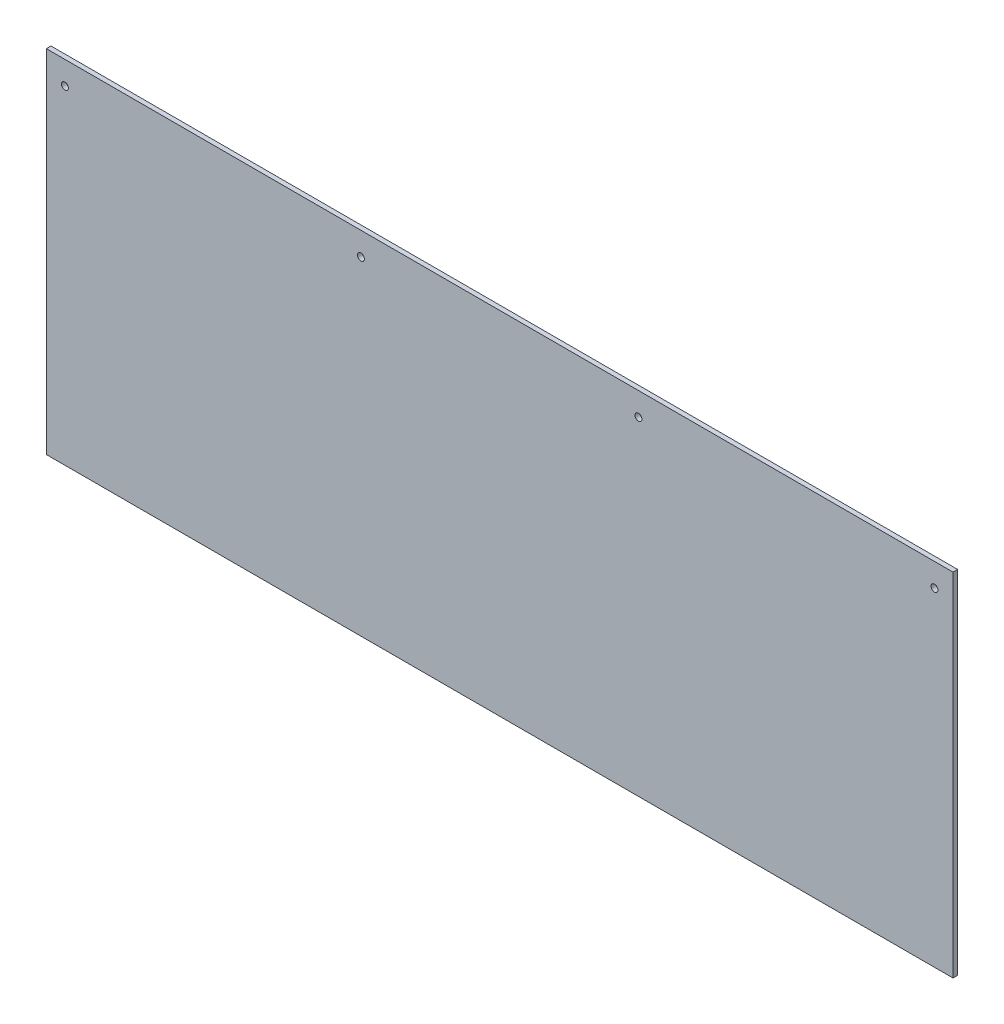
ISO-10303-21;
HEADER;
FILE_DESCRIPTION(('STEP AP214'),'2;1');
FILE_NAME('part.step','',(''),(''),'','','');
FILE_SCHEMA(('AUTOMOTIVE_DESIGN { 1 0 10303 214 1 1 1 1 }'));
ENDSEC;
DATA;
#1=APPLICATION_CONTEXT('core data for automotive mechanical design processes');
#2=APPLICATION_PROTOCOL_DEFINITION('international standard','automotive_design',2000,#1);
#3=PRODUCT_CONTEXT('',#1,'mechanical');
#4=PRODUCT('Part','Part','',(#3));
#5=PRODUCT_RELATED_PRODUCT_CATEGORY('part','',(#4));
#6=PRODUCT_DEFINITION_FORMATION('','',#4);
#7=PRODUCT_DEFINITION_CONTEXT('part definition',#1,'design');
#8=PRODUCT_DEFINITION('design','',#6,#7);
#9=PRODUCT_DEFINITION_SHAPE('','',#8);
#10=(LENGTH_UNIT() NAMED_UNIT(*) SI_UNIT(.MILLI.,.METRE.));
#11=(NAMED_UNIT(*) PLANE_ANGLE_UNIT() SI_UNIT($,.RADIAN.));
#12=(NAMED_UNIT(*) SI_UNIT($,.STERADIAN.) SOLID_ANGLE_UNIT());
#13=UNCERTAINTY_MEASURE_WITH_UNIT(LENGTH_MEASURE(1.E-05),#10,'distance_accuracy_value','');
#14=(GEOMETRIC_REPRESENTATION_CONTEXT(3) GLOBAL_UNCERTAINTY_ASSIGNED_CONTEXT((#13)) GLOBAL_UNIT_ASSIGNED_CONTEXT((#10,
#11,#12)) REPRESENTATION_CONTEXT('',''));
#15=CARTESIAN_POINT('',(0.,0.,0.));
#16=DIRECTION('',(0.,0.,1.));
#17=DIRECTION('',(1.,0.,0.));
#18=AXIS2_PLACEMENT_3D('',#15,#16,#17);
#19=CARTESIAN_POINT('',(0.,0.,6.35));
#20=DIRECTION('',(1.,0.,0.));
#21=DIRECTION('',(0.,0.,-1.));
#22=AXIS2_PLACEMENT_3D('',#19,#20,#21);
#23=PLANE('',#22);
#24=DIRECTION('',(0.,-1.,0.));
#25=VECTOR('',#24,1.);
#26=CARTESIAN_POINT('',(0.,0.,0.));
#27=LINE('',#26,#25);
#28=CARTESIAN_POINT('',(0.,482.6,0.));
#29=VERTEX_POINT('',#28);
#30=CARTESIAN_POINT('',(0.,0.,0.));
#31=VERTEX_POINT('',#30);
#32=EDGE_CURVE('E95',#29,#31,#27,.T.);
#33=ORIENTED_EDGE('',*,*,#32,.T.);
#34=DIRECTION('',(0.,0.,-1.));
#35=VECTOR('',#34,1.);
#36=CARTESIAN_POINT('',(0.,0.,6.35));
#37=LINE('',#36,#35);
#38=CARTESIAN_POINT('',(0.,0.,6.35));
#39=VERTEX_POINT('',#38);
#40=EDGE_CURVE('E11',#39,#31,#37,.T.);
#41=ORIENTED_EDGE('',*,*,#40,.F.);
#42=DIRECTION('',(0.,-1.,0.));
#43=VECTOR('',#42,1.);
#44=CARTESIAN_POINT('',(0.,0.,6.35));
#45=LINE('',#44,#43);
#46=CARTESIAN_POINT('',(0.,482.6,6.35));
#47=VERTEX_POINT('',#46);
#48=EDGE_CURVE('E83',#47,#39,#45,.T.);
#49=ORIENTED_EDGE('',*,*,#48,.F.);
#50=DIRECTION('',(0.,0.,-1.));
#51=VECTOR('',#50,1.);
#52=CARTESIAN_POINT('',(0.,482.6,6.35));
#53=LINE('',#52,#51);
#54=EDGE_CURVE('E91',#47,#29,#53,.T.);
#55=ORIENTED_EDGE('',*,*,#54,.T.);
#56=EDGE_LOOP('',(#33,#41,#49,#55));
#57=FACE_BOUND('',#56,.T.);
#58=ADVANCED_FACE('F32',(#57),#23,.F.);
#59=CARTESIAN_POINT('',(0.,0.,6.35));
#60=DIRECTION('',(0.,1.,0.));
#61=DIRECTION('',(0.,0.,1.));
#62=AXIS2_PLACEMENT_3D('',#59,#60,#61);
#63=PLANE('',#62);
#64=DIRECTION('',(1.,0.,0.));
#65=VECTOR('',#64,1.);
#66=CARTESIAN_POINT('',(0.,0.,0.));
#67=LINE('',#66,#65);
#68=CARTESIAN_POINT('',(1244.6,0.,0.));
#69=VERTEX_POINT('',#68);
#70=EDGE_CURVE('E87',#31,#69,#67,.T.);
#71=ORIENTED_EDGE('',*,*,#70,.T.);
#72=DIRECTION('',(0.,0.,-1.));
#73=VECTOR('',#72,1.);
#74=CARTESIAN_POINT('',(1244.6,0.,6.35));
#75=LINE('',#74,#73);
#76=CARTESIAN_POINT('',(1244.6,0.,6.35));
#77=VERTEX_POINT('',#76);
#78=EDGE_CURVE('E40',#77,#69,#75,.T.);
#79=ORIENTED_EDGE('',*,*,#78,.F.);
#80=DIRECTION('',(1.,0.,0.));
#81=VECTOR('',#80,1.);
#82=CARTESIAN_POINT('',(0.,0.,6.35));
#83=LINE('',#82,#81);
#84=EDGE_CURVE('E78',#39,#77,#83,.T.);
#85=ORIENTED_EDGE('',*,*,#84,.F.);
#86=ORIENTED_EDGE('',*,*,#40,.T.);
#87=EDGE_LOOP('',(#71,#79,#85,#86));
#88=FACE_BOUND('',#87,.T.);
#89=ADVANCED_FACE('F86',(#88),#63,.F.);
#90=CARTESIAN_POINT('',(1244.6,0.,6.35));
#91=DIRECTION('',(-1.,0.,0.));
#92=DIRECTION('',(0.,0.,1.));
#93=AXIS2_PLACEMENT_3D('',#90,#91,#92);
#94=PLANE('',#93);
#95=DIRECTION('',(0.,1.,0.));
#96=VECTOR('',#95,1.);
#97=CARTESIAN_POINT('',(1244.6,0.,0.));
#98=LINE('',#97,#96);
#99=CARTESIAN_POINT('',(1244.6,482.6,0.));
#100=VERTEX_POINT('',#99);
#101=EDGE_CURVE('E65',#69,#100,#98,.T.);
#102=ORIENTED_EDGE('',*,*,#101,.T.);
#103=DIRECTION('',(0.,0.,-1.));
#104=VECTOR('',#103,1.);
#105=CARTESIAN_POINT('',(1244.6,482.6,6.35));
#106=LINE('',#105,#104);
#107=CARTESIAN_POINT('',(1244.6,482.6,6.35));
#108=VERTEX_POINT('',#107);
#109=EDGE_CURVE('E88',#108,#100,#106,.T.);
#110=ORIENTED_EDGE('',*,*,#109,.F.);
#111=DIRECTION('',(0.,1.,0.));
#112=VECTOR('',#111,1.);
#113=CARTESIAN_POINT('',(1244.6,0.,6.35));
#114=LINE('',#113,#112);
#115=EDGE_CURVE('E81',#77,#108,#114,.T.);
#116=ORIENTED_EDGE('',*,*,#115,.F.);
#117=ORIENTED_EDGE('',*,*,#78,.T.);
#118=EDGE_LOOP('',(#102,#110,#116,#117));
#119=FACE_BOUND('',#118,.T.);
#120=ADVANCED_FACE('F89',(#119),#94,.F.);
#121=CARTESIAN_POINT('',(0.,482.6,6.35));
#122=DIRECTION('',(0.,-1.,0.));
#123=DIRECTION('',(1.,0.,0.));
#124=AXIS2_PLACEMENT_3D('',#121,#122,#123);
#125=PLANE('',#124);
#126=DIRECTION('',(-1.,0.,0.));
#127=VECTOR('',#126,1.);
#128=CARTESIAN_POINT('',(0.,482.6,0.));
#129=LINE('',#128,#127);
#130=EDGE_CURVE('E71',#100,#29,#129,.T.);
#131=ORIENTED_EDGE('',*,*,#130,.T.);
#132=ORIENTED_EDGE('',*,*,#54,.F.);
#133=DIRECTION('',(-1.,0.,0.));
#134=VECTOR('',#133,1.);
#135=CARTESIAN_POINT('',(0.,482.6,6.35));
#136=LINE('',#135,#134);
#137=EDGE_CURVE('E48',#108,#47,#136,.T.);
#138=ORIENTED_EDGE('',*,*,#137,.F.);
#139=ORIENTED_EDGE('',*,*,#109,.T.);
#140=EDGE_LOOP('',(#131,#132,#138,#139));
#141=FACE_BOUND('',#140,.T.);
#142=ADVANCED_FACE('F103',(#141),#125,.F.);
#143=CARTESIAN_POINT('',(0.,0.,6.35));
#144=DIRECTION('',(0.,0.,-1.));
#145=DIRECTION('',(-1.,0.,0.));
#146=AXIS2_PLACEMENT_3D('',#143,#144,#145);
#147=PLANE('',#146);
#148=CARTESIAN_POINT('',(25.4,450.85,6.35));
#149=DIRECTION('',(0.,0.,1.));
#150=DIRECTION('',(1.,0.,0.));
#151=AXIS2_PLACEMENT_3D('',#148,#149,#150);
#152=CIRCLE('',#151,4.7625);
#153=CARTESIAN_POINT('',(30.1625,450.85,6.35));
#154=VERTEX_POINT('',#153);
#155=EDGE_CURVE('E127',#154,#154,#152,.T.);
#156=ORIENTED_EDGE('',*,*,#155,.F.);
#157=EDGE_LOOP('',(#156));
#158=FACE_BOUND('',#157,.T.);
#159=CARTESIAN_POINT('',(431.8,450.85,6.35));
#160=DIRECTION('',(0.,0.,1.));
#161=DIRECTION('',(1.,0.,0.));
#162=AXIS2_PLACEMENT_3D('',#159,#160,#161);
#163=CIRCLE('',#162,4.76250000000001);
#164=CARTESIAN_POINT('',(436.5625,450.85,6.35));
#165=VERTEX_POINT('',#164);
#166=EDGE_CURVE('E121',#165,#165,#163,.T.);
#167=ORIENTED_EDGE('',*,*,#166,.F.);
#168=EDGE_LOOP('',(#167));
#169=FACE_BOUND('',#168,.T.);
#170=CARTESIAN_POINT('',(812.8,450.85,6.35));
#171=DIRECTION('',(0.,0.,1.));
#172=DIRECTION('',(1.,0.,0.));
#173=AXIS2_PLACEMENT_3D('',#170,#171,#172);
#174=CIRCLE('',#173,4.76250000000001);
#175=CARTESIAN_POINT('',(817.5625,450.85,6.35));
#176=VERTEX_POINT('',#175);
#177=EDGE_CURVE('E115',#176,#176,#174,.T.);
#178=ORIENTED_EDGE('',*,*,#177,.F.);
#179=EDGE_LOOP('',(#178));
#180=FACE_BOUND('',#179,.T.);
#181=CARTESIAN_POINT('',(1219.2,450.85,6.35));
#182=DIRECTION('',(0.,0.,1.));
#183=DIRECTION('',(1.,0.,0.));
#184=AXIS2_PLACEMENT_3D('',#181,#182,#183);
#185=CIRCLE('',#184,4.7624999999999);
#186=CARTESIAN_POINT('',(1223.9625,450.85,6.35));
#187=VERTEX_POINT('',#186);
#188=EDGE_CURVE('E109',#187,#187,#185,.T.);
#189=ORIENTED_EDGE('',*,*,#188,.F.);
#190=EDGE_LOOP('',(#189));
#191=FACE_BOUND('',#190,.T.);
#192=ORIENTED_EDGE('',*,*,#48,.T.);
#193=ORIENTED_EDGE('',*,*,#84,.T.);
#194=ORIENTED_EDGE('',*,*,#115,.T.);
#195=ORIENTED_EDGE('',*,*,#137,.T.);
#196=EDGE_LOOP('',(#192,#193,#194,#195));
#197=FACE_BOUND('',#196,.T.);
#198=ADVANCED_FACE('F79',(#158,#169,#180,#191,#197),#147,.F.);
#199=CARTESIAN_POINT('',(0.,0.,0.));
#200=DIRECTION('',(0.,0.,-1.));
#201=DIRECTION('',(-1.,0.,0.));
#202=AXIS2_PLACEMENT_3D('',#199,#200,#201);
#203=PLANE('',#202);
#204=CARTESIAN_POINT('',(25.4,450.85,0.));
#205=DIRECTION('',(0.,0.,1.));
#206=DIRECTION('',(1.,0.,0.));
#207=AXIS2_PLACEMENT_3D('',#204,#205,#206);
#208=CIRCLE('',#207,4.7625);
#209=CARTESIAN_POINT('',(30.1625,450.85,0.));
#210=VERTEX_POINT('',#209);
#211=EDGE_CURVE('E98',#210,#210,#208,.T.);
#212=ORIENTED_EDGE('',*,*,#211,.T.);
#213=EDGE_LOOP('',(#212));
#214=FACE_BOUND('',#213,.T.);
#215=CARTESIAN_POINT('',(431.8,450.85,0.));
#216=DIRECTION('',(0.,0.,1.));
#217=DIRECTION('',(1.,0.,0.));
#218=AXIS2_PLACEMENT_3D('',#215,#216,#217);
#219=CIRCLE('',#218,4.76250000000001);
#220=CARTESIAN_POINT('',(436.5625,450.85,0.));
#221=VERTEX_POINT('',#220);
#222=EDGE_CURVE('E124',#221,#221,#219,.T.);
#223=ORIENTED_EDGE('',*,*,#222,.T.);
#224=EDGE_LOOP('',(#223));
#225=FACE_BOUND('',#224,.T.);
#226=CARTESIAN_POINT('',(812.8,450.85,0.));
#227=DIRECTION('',(0.,0.,1.));
#228=DIRECTION('',(1.,0.,0.));
#229=AXIS2_PLACEMENT_3D('',#226,#227,#228);
#230=CIRCLE('',#229,4.76250000000001);
#231=CARTESIAN_POINT('',(817.5625,450.85,0.));
#232=VERTEX_POINT('',#231);
#233=EDGE_CURVE('E118',#232,#232,#230,.T.);
#234=ORIENTED_EDGE('',*,*,#233,.T.);
#235=EDGE_LOOP('',(#234));
#236=FACE_BOUND('',#235,.T.);
#237=CARTESIAN_POINT('',(1219.2,450.85,0.));
#238=DIRECTION('',(0.,0.,1.));
#239=DIRECTION('',(1.,0.,0.));
#240=AXIS2_PLACEMENT_3D('',#237,#238,#239);
#241=CIRCLE('',#240,4.7624999999999);
#242=CARTESIAN_POINT('',(1223.9625,450.85,0.));
#243=VERTEX_POINT('',#242);
#244=EDGE_CURVE('E112',#243,#243,#241,.T.);
#245=ORIENTED_EDGE('',*,*,#244,.T.);
#246=EDGE_LOOP('',(#245));
#247=FACE_BOUND('',#246,.T.);
#248=ORIENTED_EDGE('',*,*,#32,.F.);
#249=ORIENTED_EDGE('',*,*,#130,.F.);
#250=ORIENTED_EDGE('',*,*,#101,.F.);
#251=ORIENTED_EDGE('',*,*,#70,.F.);
#252=EDGE_LOOP('',(#248,#249,#250,#251));
#253=FACE_BOUND('',#252,.T.);
#254=ADVANCED_FACE('F106',(#214,#225,#236,#247,#253),#203,.T.);
#255=CARTESIAN_POINT('',(1219.2,450.85,0.));
#256=DIRECTION('',(0.,0.,1.));
#257=DIRECTION('',(1.,0.,0.));
#258=AXIS2_PLACEMENT_3D('',#255,#256,#257);
#259=CYLINDRICAL_SURFACE('',#258,4.7624999999999);
#260=ORIENTED_EDGE('',*,*,#244,.F.);
#261=EDGE_LOOP('',(#260));
#262=FACE_BOUND('',#261,.T.);
#263=ORIENTED_EDGE('',*,*,#188,.T.);
#264=EDGE_LOOP('',(#263));
#265=FACE_BOUND('',#264,.T.);
#266=ADVANCED_FACE('F151',(#262,#265),#259,.F.);
#267=CARTESIAN_POINT('',(812.8,450.85,0.));
#268=DIRECTION('',(0.,0.,1.));
#269=DIRECTION('',(1.,0.,0.));
#270=AXIS2_PLACEMENT_3D('',#267,#268,#269);
#271=CYLINDRICAL_SURFACE('',#270,4.76250000000001);
#272=ORIENTED_EDGE('',*,*,#233,.F.);
#273=EDGE_LOOP('',(#272));
#274=FACE_BOUND('',#273,.T.);
#275=ORIENTED_EDGE('',*,*,#177,.T.);
#276=EDGE_LOOP('',(#275));
#277=FACE_BOUND('',#276,.T.);
#278=ADVANCED_FACE('F153',(#274,#277),#271,.F.);
#279=CARTESIAN_POINT('',(431.8,450.85,0.));
#280=DIRECTION('',(0.,0.,1.));
#281=DIRECTION('',(1.,0.,0.));
#282=AXIS2_PLACEMENT_3D('',#279,#280,#281);
#283=CYLINDRICAL_SURFACE('',#282,4.76250000000001);
#284=ORIENTED_EDGE('',*,*,#222,.F.);
#285=EDGE_LOOP('',(#284));
#286=FACE_BOUND('',#285,.T.);
#287=ORIENTED_EDGE('',*,*,#166,.T.);
#288=EDGE_LOOP('',(#287));
#289=FACE_BOUND('',#288,.T.);
#290=ADVANCED_FACE('F138',(#286,#289),#283,.F.);
#291=CARTESIAN_POINT('',(25.4,450.85,0.));
#292=DIRECTION('',(0.,0.,1.));
#293=DIRECTION('',(1.,0.,0.));
#294=AXIS2_PLACEMENT_3D('',#291,#292,#293);
#295=CYLINDRICAL_SURFACE('',#294,4.7625);
#296=ORIENTED_EDGE('',*,*,#211,.F.);
#297=EDGE_LOOP('',(#296));
#298=FACE_BOUND('',#297,.T.);
#299=ORIENTED_EDGE('',*,*,#155,.T.);
#300=EDGE_LOOP('',(#299));
#301=FACE_BOUND('',#300,.T.);
#302=ADVANCED_FACE('F135',(#298,#301),#295,.F.);
#303=CLOSED_SHELL('',(#58,#89,#120,#142,#198,#254,#266,#278,#290,#302));
#304=MANIFOLD_SOLID_BREP('B2',#303);
#305=ADVANCED_BREP_SHAPE_REPRESENTATION('',(#18,#304),#14);
#306=SHAPE_DEFINITION_REPRESENTATION(#9,#305);
ENDSEC;
END-ISO-10303-21;
